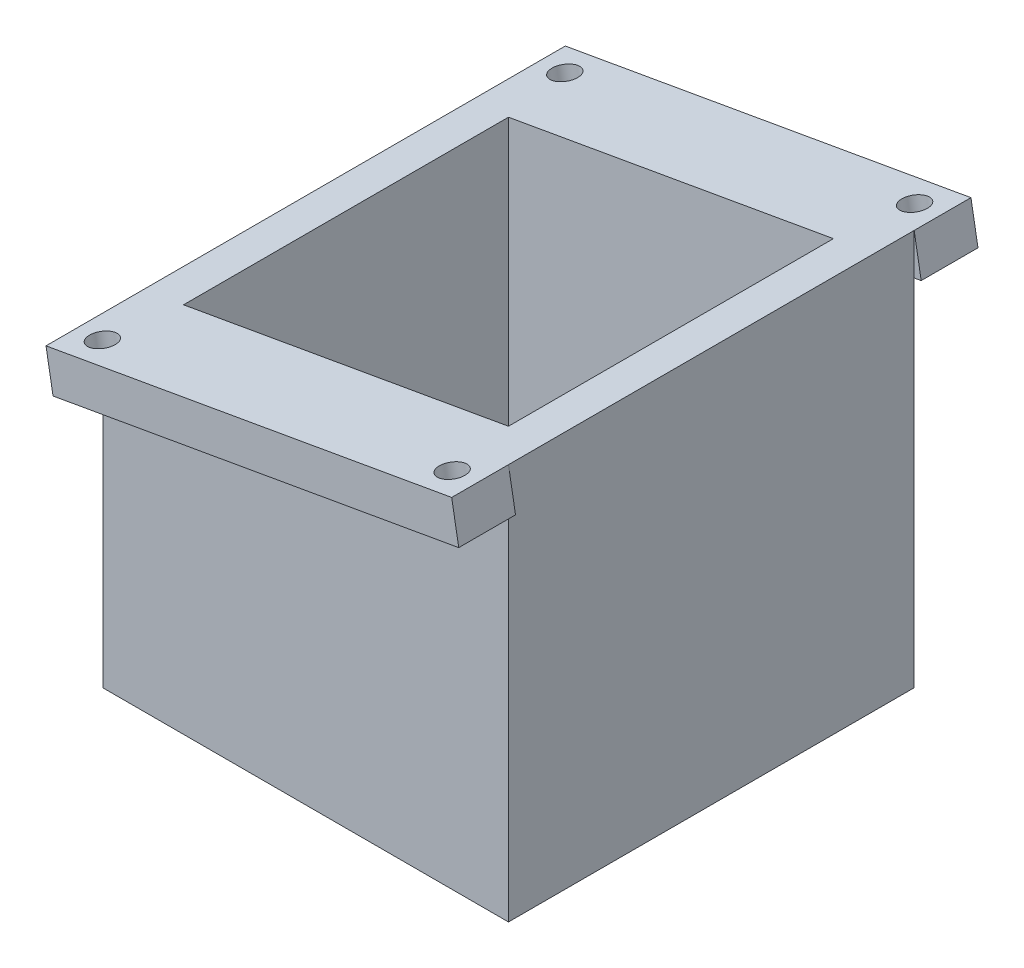
ISO-10303-21;
HEADER;
FILE_DESCRIPTION(('STEP AP214'),'2;1');
FILE_NAME('part.step','',(''),(''),'','','');
FILE_SCHEMA(('AUTOMOTIVE_DESIGN { 1 0 10303 214 1 1 1 1 }'));
ENDSEC;
DATA;
#1=APPLICATION_CONTEXT('core data for automotive mechanical design processes');
#2=APPLICATION_PROTOCOL_DEFINITION('international standard','automotive_design',2000,#1);
#3=PRODUCT_CONTEXT('',#1,'mechanical');
#4=PRODUCT('Part','Part','',(#3));
#5=PRODUCT_RELATED_PRODUCT_CATEGORY('part','',(#4));
#6=PRODUCT_DEFINITION_FORMATION('','',#4);
#7=PRODUCT_DEFINITION_CONTEXT('part definition',#1,'design');
#8=PRODUCT_DEFINITION('design','',#6,#7);
#9=PRODUCT_DEFINITION_SHAPE('','',#8);
#10=(LENGTH_UNIT() NAMED_UNIT(*) SI_UNIT(.MILLI.,.METRE.));
#11=(NAMED_UNIT(*) PLANE_ANGLE_UNIT() SI_UNIT($,.RADIAN.));
#12=(NAMED_UNIT(*) SI_UNIT($,.STERADIAN.) SOLID_ANGLE_UNIT());
#13=UNCERTAINTY_MEASURE_WITH_UNIT(LENGTH_MEASURE(1.E-05),#10,'distance_accuracy_value','');
#14=(GEOMETRIC_REPRESENTATION_CONTEXT(3) GLOBAL_UNCERTAINTY_ASSIGNED_CONTEXT((#13)) GLOBAL_UNIT_ASSIGNED_CONTEXT((#10,
#11,#12)) REPRESENTATION_CONTEXT('',''));
#15=CARTESIAN_POINT('',(0.,0.,0.));
#16=DIRECTION('',(0.,0.,1.));
#17=DIRECTION('',(1.,0.,0.));
#18=AXIS2_PLACEMENT_3D('',#15,#16,#17);
#19=CARTESIAN_POINT('',(25.,5.,-25.));
#20=DIRECTION('',(0.,0.,1.));
#21=DIRECTION('',(1.,0.,0.));
#22=AXIS2_PLACEMENT_3D('',#19,#20,#21);
#23=PLANE('',#22);
#24=DIRECTION('',(-0.17364819609251,0.984807749763281,0.));
#25=VECTOR('',#24,1.);
#26=CARTESIAN_POINT('',(-24.1317590195375,35.0759612511836,-25.));
#27=LINE('',#26,#25);
#28=CARTESIAN_POINT('',(-24.1317590195375,35.0759612511836,-25.));
#29=VERTEX_POINT('',#28);
#30=CARTESIAN_POINT('',(-25.,40.,-25.));
#31=VERTEX_POINT('',#30);
#32=EDGE_CURVE('E302',#29,#31,#27,.T.);
#33=ORIENTED_EDGE('',*,*,#32,.F.);
#34=DIRECTION('',(0.984807749763281,0.17364819609251,0.));
#35=VECTOR('',#34,1.);
#36=CARTESIAN_POINT('',(-24.1317590195375,35.0759612511836,-25.));
#37=LINE('',#36,#35);
#38=CARTESIAN_POINT('',(25.,43.7392169238216,-25.));
#39=VERTEX_POINT('',#38);
#40=EDGE_CURVE('E293',#29,#39,#37,.T.);
#41=ORIENTED_EDGE('',*,*,#40,.T.);
#42=DIRECTION('',(0.,-1.,0.));
#43=VECTOR('',#42,1.);
#44=CARTESIAN_POINT('',(25.,5.,-25.));
#45=LINE('',#44,#43);
#46=CARTESIAN_POINT('',(25.,0.,-25.));
#47=VERTEX_POINT('',#46);
#48=EDGE_CURVE('E286',#39,#47,#45,.T.);
#49=ORIENTED_EDGE('',*,*,#48,.T.);
#50=DIRECTION('',(-1.,0.,0.));
#51=VECTOR('',#50,1.);
#52=CARTESIAN_POINT('',(25.,0.,-25.));
#53=LINE('',#52,#51);
#54=CARTESIAN_POINT('',(-25.,0.,-25.));
#55=VERTEX_POINT('',#54);
#56=EDGE_CURVE('E281',#47,#55,#53,.T.);
#57=ORIENTED_EDGE('',*,*,#56,.T.);
#58=DIRECTION('',(0.,-1.,0.));
#59=VECTOR('',#58,1.);
#60=CARTESIAN_POINT('',(-25.,5.,-25.));
#61=LINE('',#60,#59);
#62=EDGE_CURVE('E283',#31,#55,#61,.T.);
#63=ORIENTED_EDGE('',*,*,#62,.F.);
#64=EDGE_LOOP('',(#33,#41,#49,#57,#63));
#65=FACE_BOUND('',#64,.T.);
#66=ADVANCED_FACE('F40',(#65),#23,.F.);
#67=CARTESIAN_POINT('',(0.,5.,0.));
#68=DIRECTION('',(0.,-1.,0.));
#69=DIRECTION('',(0.,0.,-1.));
#70=AXIS2_PLACEMENT_3D('',#67,#68,#69);
#71=PLANE('',#70);
#72=DIRECTION('',(0.,0.,-1.));
#73=VECTOR('',#72,1.);
#74=CARTESIAN_POINT('',(20.025,5.,0.));
#75=LINE('',#74,#73);
#76=CARTESIAN_POINT('',(20.025,5.,20.025));
#77=VERTEX_POINT('',#76);
#78=CARTESIAN_POINT('',(20.025,5.,-20.025));
#79=VERTEX_POINT('',#78);
#80=EDGE_CURVE('E236',#77,#79,#75,.T.);
#81=ORIENTED_EDGE('',*,*,#80,.T.);
#82=DIRECTION('',(-1.,0.,0.));
#83=VECTOR('',#82,1.);
#84=CARTESIAN_POINT('',(0.,5.,-20.025));
#85=LINE('',#84,#83);
#86=CARTESIAN_POINT('',(-20.025,5.,-20.025));
#87=VERTEX_POINT('',#86);
#88=EDGE_CURVE('E239',#79,#87,#85,.T.);
#89=ORIENTED_EDGE('',*,*,#88,.T.);
#90=DIRECTION('',(0.,0.,1.));
#91=VECTOR('',#90,1.);
#92=CARTESIAN_POINT('',(-20.025,5.,0.));
#93=LINE('',#92,#91);
#94=CARTESIAN_POINT('',(-20.025,5.,20.025));
#95=VERTEX_POINT('',#94);
#96=EDGE_CURVE('E230',#87,#95,#93,.T.);
#97=ORIENTED_EDGE('',*,*,#96,.T.);
#98=DIRECTION('',(1.,0.,0.));
#99=VECTOR('',#98,1.);
#100=CARTESIAN_POINT('',(0.,5.,20.025));
#101=LINE('',#100,#99);
#102=EDGE_CURVE('E233',#95,#77,#101,.T.);
#103=ORIENTED_EDGE('',*,*,#102,.T.);
#104=EDGE_LOOP('',(#81,#89,#97,#103));
#105=FACE_BOUND('',#104,.T.);
#106=DIRECTION('',(0.,0.,1.));
#107=VECTOR('',#106,1.);
#108=CARTESIAN_POINT('',(-18.025,5.,-18.025));
#109=LINE('',#108,#107);
#110=CARTESIAN_POINT('',(-18.025,5.,-18.025));
#111=VERTEX_POINT('',#110);
#112=CARTESIAN_POINT('',(-18.025,5.,18.025));
#113=VERTEX_POINT('',#112);
#114=EDGE_CURVE('E243',#111,#113,#109,.T.);
#115=ORIENTED_EDGE('',*,*,#114,.F.);
#116=DIRECTION('',(-1.,0.,0.));
#117=VECTOR('',#116,1.);
#118=CARTESIAN_POINT('',(18.025,5.,-18.025));
#119=LINE('',#118,#117);
#120=CARTESIAN_POINT('',(18.025,5.,-18.025));
#121=VERTEX_POINT('',#120);
#122=EDGE_CURVE('E251',#121,#111,#119,.T.);
#123=ORIENTED_EDGE('',*,*,#122,.F.);
#124=DIRECTION('',(0.,0.,-1.));
#125=VECTOR('',#124,1.);
#126=CARTESIAN_POINT('',(18.025,5.,-18.025));
#127=LINE('',#126,#125);
#128=CARTESIAN_POINT('',(18.025,5.,18.025));
#129=VERTEX_POINT('',#128);
#130=EDGE_CURVE('E248',#129,#121,#127,.T.);
#131=ORIENTED_EDGE('',*,*,#130,.F.);
#132=DIRECTION('',(1.,0.,0.));
#133=VECTOR('',#132,1.);
#134=CARTESIAN_POINT('',(18.025,5.,18.025));
#135=LINE('',#134,#133);
#136=EDGE_CURVE('E245',#113,#129,#135,.T.);
#137=ORIENTED_EDGE('',*,*,#136,.F.);
#138=EDGE_LOOP('',(#115,#123,#131,#137));
#139=FACE_BOUND('',#138,.T.);
#140=ADVANCED_FACE('F333',(#105,#139),#71,.F.);
#141=CARTESIAN_POINT('',(0.,0.,0.));
#142=DIRECTION('',(0.,-1.,0.));
#143=DIRECTION('',(0.,0.,-1.));
#144=AXIS2_PLACEMENT_3D('',#141,#142,#143);
#145=PLANE('',#144);
#146=DIRECTION('',(-1.,0.,0.));
#147=VECTOR('',#146,1.);
#148=CARTESIAN_POINT('',(18.025,0.,-18.025));
#149=LINE('',#148,#147);
#150=CARTESIAN_POINT('',(18.025,0.,-18.025));
#151=VERTEX_POINT('',#150);
#152=CARTESIAN_POINT('',(-18.025,0.,-18.025));
#153=VERTEX_POINT('',#152);
#154=EDGE_CURVE('E246',#151,#153,#149,.T.);
#155=ORIENTED_EDGE('',*,*,#154,.T.);
#156=DIRECTION('',(0.,0.,1.));
#157=VECTOR('',#156,1.);
#158=CARTESIAN_POINT('',(-18.025,0.,-18.025));
#159=LINE('',#158,#157);
#160=CARTESIAN_POINT('',(-18.025,0.,18.025));
#161=VERTEX_POINT('',#160);
#162=EDGE_CURVE('E242',#153,#161,#159,.T.);
#163=ORIENTED_EDGE('',*,*,#162,.T.);
#164=DIRECTION('',(1.,0.,0.));
#165=VECTOR('',#164,1.);
#166=CARTESIAN_POINT('',(18.025,0.,18.025));
#167=LINE('',#166,#165);
#168=CARTESIAN_POINT('',(18.025,0.,18.025));
#169=VERTEX_POINT('',#168);
#170=EDGE_CURVE('E256',#161,#169,#167,.T.);
#171=ORIENTED_EDGE('',*,*,#170,.T.);
#172=DIRECTION('',(0.,0.,-1.));
#173=VECTOR('',#172,1.);
#174=CARTESIAN_POINT('',(18.025,0.,-18.025));
#175=LINE('',#174,#173);
#176=EDGE_CURVE('E259',#169,#151,#175,.T.);
#177=ORIENTED_EDGE('',*,*,#176,.T.);
#178=EDGE_LOOP('',(#155,#163,#171,#177));
#179=FACE_BOUND('',#178,.T.);
#180=DIRECTION('',(0.,0.,1.));
#181=VECTOR('',#180,1.);
#182=CARTESIAN_POINT('',(-25.,0.,-25.));
#183=LINE('',#182,#181);
#184=CARTESIAN_POINT('',(-25.,0.,25.));
#185=VERTEX_POINT('',#184);
#186=EDGE_CURVE('E273',#55,#185,#183,.T.);
#187=ORIENTED_EDGE('',*,*,#186,.F.);
#188=ORIENTED_EDGE('',*,*,#56,.F.);
#189=DIRECTION('',(0.,0.,-1.));
#190=VECTOR('',#189,1.);
#191=CARTESIAN_POINT('',(25.,0.,-25.));
#192=LINE('',#191,#190);
#193=CARTESIAN_POINT('',(25.,0.,25.));
#194=VERTEX_POINT('',#193);
#195=EDGE_CURVE('E279',#194,#47,#192,.T.);
#196=ORIENTED_EDGE('',*,*,#195,.F.);
#197=DIRECTION('',(1.,0.,0.));
#198=VECTOR('',#197,1.);
#199=CARTESIAN_POINT('',(25.,0.,25.));
#200=LINE('',#199,#198);
#201=EDGE_CURVE('E276',#185,#194,#200,.T.);
#202=ORIENTED_EDGE('',*,*,#201,.F.);
#203=EDGE_LOOP('',(#187,#188,#196,#202));
#204=FACE_BOUND('',#203,.T.);
#205=ADVANCED_FACE('F297',(#179,#204),#145,.T.);
#206=CARTESIAN_POINT('',(-25.,5.,-25.));
#207=DIRECTION('',(1.,0.,0.));
#208=DIRECTION('',(0.,0.,-1.));
#209=AXIS2_PLACEMENT_3D('',#206,#207,#208);
#210=PLANE('',#209);
#211=ORIENTED_EDGE('',*,*,#186,.T.);
#212=DIRECTION('',(0.,-1.,0.));
#213=VECTOR('',#212,1.);
#214=CARTESIAN_POINT('',(-25.,5.,25.));
#215=LINE('',#214,#213);
#216=CARTESIAN_POINT('',(-25.,40.,25.));
#217=VERTEX_POINT('',#216);
#218=EDGE_CURVE('E44',#217,#185,#215,.T.);
#219=ORIENTED_EDGE('',*,*,#218,.F.);
#220=DIRECTION('',(0.,0.,1.));
#221=VECTOR('',#220,1.);
#222=CARTESIAN_POINT('',(-25.,40.,25.));
#223=LINE('',#222,#221);
#224=EDGE_CURVE('E212',#31,#217,#223,.T.);
#225=ORIENTED_EDGE('',*,*,#224,.F.);
#226=ORIENTED_EDGE('',*,*,#62,.T.);
#227=EDGE_LOOP('',(#211,#219,#225,#226));
#228=FACE_BOUND('',#227,.T.);
#229=ADVANCED_FACE('F42',(#228),#210,.F.);
#230=CARTESIAN_POINT('',(25.,5.,25.));
#231=DIRECTION('',(0.,0.,-1.));
#232=DIRECTION('',(-1.,0.,0.));
#233=AXIS2_PLACEMENT_3D('',#230,#231,#232);
#234=PLANE('',#233);
#235=DIRECTION('',(0.,-1.,0.));
#236=VECTOR('',#235,1.);
#237=CARTESIAN_POINT('',(25.,5.,25.));
#238=LINE('',#237,#236);
#239=CARTESIAN_POINT('',(25.,43.7392169238216,25.));
#240=VERTEX_POINT('',#239);
#241=EDGE_CURVE('E181',#240,#194,#238,.T.);
#242=ORIENTED_EDGE('',*,*,#241,.F.);
#243=DIRECTION('',(-0.984807749763281,-0.17364819609251,0.));
#244=VECTOR('',#243,1.);
#245=CARTESIAN_POINT('',(-24.1317590195375,35.0759612511836,25.));
#246=LINE('',#245,#244);
#247=CARTESIAN_POINT('',(-24.1317590195375,35.0759612511836,25.));
#248=VERTEX_POINT('',#247);
#249=EDGE_CURVE('E11',#240,#248,#246,.T.);
#250=ORIENTED_EDGE('',*,*,#249,.T.);
#251=DIRECTION('',(-0.17364819609251,0.984807749763281,0.));
#252=VECTOR('',#251,1.);
#253=CARTESIAN_POINT('',(-24.1317590195375,35.0759612511836,25.));
#254=LINE('',#253,#252);
#255=EDGE_CURVE('E363',#248,#217,#254,.T.);
#256=ORIENTED_EDGE('',*,*,#255,.T.);
#257=ORIENTED_EDGE('',*,*,#218,.T.);
#258=ORIENTED_EDGE('',*,*,#201,.T.);
#259=EDGE_LOOP('',(#242,#250,#256,#257,#258));
#260=FACE_BOUND('',#259,.T.);
#261=ADVANCED_FACE('F356',(#260),#234,.F.);
#262=CARTESIAN_POINT('',(25.,5.,-25.));
#263=DIRECTION('',(-1.,0.,0.));
#264=DIRECTION('',(0.,0.,1.));
#265=AXIS2_PLACEMENT_3D('',#262,#263,#264);
#266=PLANE('',#265);
#267=ORIENTED_EDGE('',*,*,#195,.T.);
#268=ORIENTED_EDGE('',*,*,#48,.F.);
#269=CARTESIAN_POINT('',(25.,48.81635,-25.));
#270=VERTEX_POINT('',#269);
#271=EDGE_CURVE('E207',#270,#39,#45,.T.);
#272=ORIENTED_EDGE('',*,*,#271,.F.);
#273=DIRECTION('',(0.,0.,-1.));
#274=VECTOR('',#273,1.);
#275=CARTESIAN_POINT('',(25.,48.81635,25.));
#276=LINE('',#275,#274);
#277=CARTESIAN_POINT('',(25.,48.81635,25.));
#278=VERTEX_POINT('',#277);
#279=EDGE_CURVE('E198',#278,#270,#276,.T.);
#280=ORIENTED_EDGE('',*,*,#279,.F.);
#281=EDGE_CURVE('E173',#278,#240,#238,.T.);
#282=ORIENTED_EDGE('',*,*,#281,.T.);
#283=ORIENTED_EDGE('',*,*,#241,.T.);
#284=EDGE_LOOP('',(#267,#268,#272,#280,#282,#283));
#285=FACE_BOUND('',#284,.T.);
#286=ADVANCED_FACE('F205',(#285),#266,.F.);
#287=CARTESIAN_POINT('',(-18.025,5.,-18.025));
#288=DIRECTION('',(1.,0.,0.));
#289=DIRECTION('',(0.,0.,-1.));
#290=AXIS2_PLACEMENT_3D('',#287,#288,#289);
#291=PLANE('',#290);
#292=ORIENTED_EDGE('',*,*,#162,.F.);
#293=DIRECTION('',(0.,-1.,0.));
#294=VECTOR('',#293,1.);
#295=CARTESIAN_POINT('',(-18.025,5.,-18.025));
#296=LINE('',#295,#294);
#297=EDGE_CURVE('E253',#111,#153,#296,.T.);
#298=ORIENTED_EDGE('',*,*,#297,.F.);
#299=ORIENTED_EDGE('',*,*,#114,.T.);
#300=DIRECTION('',(0.,-1.,0.));
#301=VECTOR('',#300,1.);
#302=CARTESIAN_POINT('',(-18.025,5.,18.025));
#303=LINE('',#302,#301);
#304=EDGE_CURVE('E270',#113,#161,#303,.T.);
#305=ORIENTED_EDGE('',*,*,#304,.T.);
#306=EDGE_LOOP('',(#292,#298,#299,#305));
#307=FACE_BOUND('',#306,.T.);
#308=ADVANCED_FACE('F355',(#307),#291,.T.);
#309=CARTESIAN_POINT('',(18.025,5.,18.025));
#310=DIRECTION('',(0.,0.,-1.));
#311=DIRECTION('',(-1.,0.,0.));
#312=AXIS2_PLACEMENT_3D('',#309,#310,#311);
#313=PLANE('',#312);
#314=ORIENTED_EDGE('',*,*,#170,.F.);
#315=ORIENTED_EDGE('',*,*,#304,.F.);
#316=ORIENTED_EDGE('',*,*,#136,.T.);
#317=DIRECTION('',(0.,-1.,0.));
#318=VECTOR('',#317,1.);
#319=CARTESIAN_POINT('',(18.025,5.,18.025));
#320=LINE('',#319,#318);
#321=EDGE_CURVE('E268',#129,#169,#320,.T.);
#322=ORIENTED_EDGE('',*,*,#321,.T.);
#323=EDGE_LOOP('',(#314,#315,#316,#322));
#324=FACE_BOUND('',#323,.T.);
#325=ADVANCED_FACE('F645',(#324),#313,.T.);
#326=CARTESIAN_POINT('',(18.025,5.,-18.025));
#327=DIRECTION('',(-1.,0.,0.));
#328=DIRECTION('',(0.,0.,1.));
#329=AXIS2_PLACEMENT_3D('',#326,#327,#328);
#330=PLANE('',#329);
#331=ORIENTED_EDGE('',*,*,#176,.F.);
#332=ORIENTED_EDGE('',*,*,#321,.F.);
#333=ORIENTED_EDGE('',*,*,#130,.T.);
#334=DIRECTION('',(0.,-1.,0.));
#335=VECTOR('',#334,1.);
#336=CARTESIAN_POINT('',(18.025,5.,-18.025));
#337=LINE('',#336,#335);
#338=EDGE_CURVE('E266',#121,#151,#337,.T.);
#339=ORIENTED_EDGE('',*,*,#338,.T.);
#340=EDGE_LOOP('',(#331,#332,#333,#339));
#341=FACE_BOUND('',#340,.T.);
#342=ADVANCED_FACE('F634',(#341),#330,.T.);
#343=CARTESIAN_POINT('',(18.025,5.,-18.025));
#344=DIRECTION('',(0.,0.,1.));
#345=DIRECTION('',(1.,0.,0.));
#346=AXIS2_PLACEMENT_3D('',#343,#344,#345);
#347=PLANE('',#346);
#348=ORIENTED_EDGE('',*,*,#154,.F.);
#349=ORIENTED_EDGE('',*,*,#338,.F.);
#350=ORIENTED_EDGE('',*,*,#122,.T.);
#351=ORIENTED_EDGE('',*,*,#297,.T.);
#352=EDGE_LOOP('',(#348,#349,#350,#351));
#353=FACE_BOUND('',#352,.T.);
#354=ADVANCED_FACE('F344',(#353),#347,.T.);
#355=CARTESIAN_POINT('',(20.025,110.710678118655,-20.025));
#356=DIRECTION('',(0.,0.,1.));
#357=DIRECTION('',(1.,0.,0.));
#358=AXIS2_PLACEMENT_3D('',#355,#356,#357);
#359=PLANE('',#358);
#360=ORIENTED_EDGE('',*,*,#88,.F.);
#361=DIRECTION('',(0.,-1.,0.));
#362=VECTOR('',#361,1.);
#363=CARTESIAN_POINT('',(20.025,110.710678118655,-20.025));
#364=LINE('',#363,#362);
#365=CARTESIAN_POINT('',(20.025,47.939123175,-20.025));
#366=VERTEX_POINT('',#365);
#367=EDGE_CURVE('E223',#366,#79,#364,.T.);
#368=ORIENTED_EDGE('',*,*,#367,.F.);
#369=DIRECTION('',(-0.984807749763281,-0.17364819609251,0.));
#370=VECTOR('',#369,1.);
#371=CARTESIAN_POINT('',(31.6066827751661,49.9812865536967,-20.025));
#372=LINE('',#371,#370);
#373=CARTESIAN_POINT('',(-20.025,40.877226825,-20.025));
#374=VERTEX_POINT('',#373);
#375=EDGE_CURVE('E208',#366,#374,#372,.T.);
#376=ORIENTED_EDGE('',*,*,#375,.T.);
#377=DIRECTION('',(0.,-1.,0.));
#378=VECTOR('',#377,1.);
#379=CARTESIAN_POINT('',(-20.025,110.710678118655,-20.025));
#380=LINE('',#379,#378);
#381=EDGE_CURVE('E220',#374,#87,#380,.T.);
#382=ORIENTED_EDGE('',*,*,#381,.T.);
#383=EDGE_LOOP('',(#360,#368,#376,#382));
#384=FACE_BOUND('',#383,.T.);
#385=ADVANCED_FACE('F331',(#384),#359,.T.);
#386=CARTESIAN_POINT('',(20.025,110.710678118655,20.025));
#387=DIRECTION('',(-1.,0.,0.));
#388=DIRECTION('',(0.,0.,1.));
#389=AXIS2_PLACEMENT_3D('',#386,#387,#388);
#390=PLANE('',#389);
#391=ORIENTED_EDGE('',*,*,#80,.F.);
#392=DIRECTION('',(0.,-1.,0.));
#393=VECTOR('',#392,1.);
#394=CARTESIAN_POINT('',(20.025,110.710678118655,20.025));
#395=LINE('',#394,#393);
#396=CARTESIAN_POINT('',(20.025,47.939123175,20.025));
#397=VERTEX_POINT('',#396);
#398=EDGE_CURVE('E226',#397,#77,#395,.T.);
#399=ORIENTED_EDGE('',*,*,#398,.F.);
#400=DIRECTION('',(0.,0.,-1.));
#401=VECTOR('',#400,1.);
#402=CARTESIAN_POINT('',(20.025,47.939123175,20.025));
#403=LINE('',#402,#401);
#404=EDGE_CURVE('E307',#397,#366,#403,.T.);
#405=ORIENTED_EDGE('',*,*,#404,.T.);
#406=ORIENTED_EDGE('',*,*,#367,.T.);
#407=EDGE_LOOP('',(#391,#399,#405,#406));
#408=FACE_BOUND('',#407,.T.);
#409=ADVANCED_FACE('F336',(#408),#390,.T.);
#410=CARTESIAN_POINT('',(20.025,110.710678118655,20.025));
#411=DIRECTION('',(0.,0.,-1.));
#412=DIRECTION('',(-1.,0.,0.));
#413=AXIS2_PLACEMENT_3D('',#410,#411,#412);
#414=PLANE('',#413);
#415=ORIENTED_EDGE('',*,*,#102,.F.);
#416=DIRECTION('',(0.,-1.,0.));
#417=VECTOR('',#416,1.);
#418=CARTESIAN_POINT('',(-20.025,110.710678118655,20.025));
#419=LINE('',#418,#417);
#420=CARTESIAN_POINT('',(-20.025,40.877226825,20.025));
#421=VERTEX_POINT('',#420);
#422=EDGE_CURVE('E65',#421,#95,#419,.T.);
#423=ORIENTED_EDGE('',*,*,#422,.F.);
#424=DIRECTION('',(0.984807749763281,0.17364819609251,0.));
#425=VECTOR('',#424,1.);
#426=CARTESIAN_POINT('',(31.6066827751661,49.9812865536967,20.025));
#427=LINE('',#426,#425);
#428=EDGE_CURVE('E214',#421,#397,#427,.T.);
#429=ORIENTED_EDGE('',*,*,#428,.T.);
#430=ORIENTED_EDGE('',*,*,#398,.T.);
#431=EDGE_LOOP('',(#415,#423,#429,#430));
#432=FACE_BOUND('',#431,.T.);
#433=ADVANCED_FACE('F324',(#432),#414,.T.);
#434=CARTESIAN_POINT('',(-20.025,110.710678118655,20.025));
#435=DIRECTION('',(1.,0.,0.));
#436=DIRECTION('',(0.,0.,-1.));
#437=AXIS2_PLACEMENT_3D('',#434,#435,#436);
#438=PLANE('',#437);
#439=ORIENTED_EDGE('',*,*,#96,.F.);
#440=ORIENTED_EDGE('',*,*,#381,.F.);
#441=DIRECTION('',(0.,0.,1.));
#442=VECTOR('',#441,1.);
#443=CARTESIAN_POINT('',(-20.025,40.877226825,20.025));
#444=LINE('',#443,#442);
#445=EDGE_CURVE('E209',#374,#421,#444,.T.);
#446=ORIENTED_EDGE('',*,*,#445,.T.);
#447=ORIENTED_EDGE('',*,*,#422,.T.);
#448=EDGE_LOOP('',(#439,#440,#446,#447));
#449=FACE_BOUND('',#448,.T.);
#450=ADVANCED_FACE('F329',(#449),#438,.T.);
#451=CARTESIAN_POINT('',(-7.59424596992729,43.0691043908606,0.));
#452=DIRECTION('',(-0.17364819609251,0.984807749763281,0.));
#453=DIRECTION('',(-0.984807749763281,-0.17364819609251,0.));
#454=AXIS2_PLACEMENT_3D('',#451,#452,#453);
#455=PLANE('',#454);
#456=CARTESIAN_POINT('',(-21.5531728758285,40.6077686863238,-28.5));
#457=DIRECTION('',(-0.17364819609251,0.984807749763281,0.));
#458=DIRECTION('',(0.984807749763281,0.17364819609251,0.));
#459=AXIS2_PLACEMENT_3D('',#456,#457,#458);
#460=CIRCLE('',#459,1.60000000000001);
#461=CARTESIAN_POINT('',(-19.9774804762073,40.8856058000718,-28.5));
#462=VERTEX_POINT('',#461);
#463=EDGE_CURVE('E429',#462,#462,#460,.T.);
#464=ORIENTED_EDGE('',*,*,#463,.F.);
#465=EDGE_LOOP('',(#464));
#466=FACE_BOUND('',#465,.T.);
#467=CARTESIAN_POINT('',(21.5531728758285,48.2085813136762,-28.5));
#468=DIRECTION('',(-0.17364819609251,0.984807749763281,0.));
#469=DIRECTION('',(-0.984807749763281,-0.17364819609251,0.));
#470=AXIS2_PLACEMENT_3D('',#467,#468,#469);
#471=CIRCLE('',#470,1.6);
#472=CARTESIAN_POINT('',(19.9774804762073,47.9307441999282,-28.5));
#473=VERTEX_POINT('',#472);
#474=EDGE_CURVE('E433',#473,#473,#471,.T.);
#475=ORIENTED_EDGE('',*,*,#474,.F.);
#476=EDGE_LOOP('',(#475));
#477=FACE_BOUND('',#476,.T.);
#478=CARTESIAN_POINT('',(21.5531728758285,48.2085813136762,28.5));
#479=DIRECTION('',(-0.17364819609251,0.984807749763281,0.));
#480=DIRECTION('',(0.984807749763281,0.17364819609251,0.));
#481=AXIS2_PLACEMENT_3D('',#478,#479,#480);
#482=CIRCLE('',#481,1.6);
#483=CARTESIAN_POINT('',(23.1288652754497,48.4864184274242,28.5));
#484=VERTEX_POINT('',#483);
#485=EDGE_CURVE('E437',#484,#484,#482,.T.);
#486=ORIENTED_EDGE('',*,*,#485,.F.);
#487=EDGE_LOOP('',(#486));
#488=FACE_BOUND('',#487,.T.);
#489=CARTESIAN_POINT('',(-21.5531728758285,40.6077686863238,28.5));
#490=DIRECTION('',(-0.17364819609251,0.984807749763281,0.));
#491=DIRECTION('',(-0.984807749763281,-0.17364819609251,0.));
#492=AXIS2_PLACEMENT_3D('',#489,#490,#491);
#493=CIRCLE('',#492,1.60000000000001);
#494=CARTESIAN_POINT('',(-23.1288652754498,40.3299315725758,28.5));
#495=VERTEX_POINT('',#494);
#496=EDGE_CURVE('E373',#495,#495,#493,.T.);
#497=ORIENTED_EDGE('',*,*,#496,.F.);
#498=EDGE_LOOP('',(#497));
#499=FACE_BOUND('',#498,.T.);
#500=ORIENTED_EDGE('',*,*,#445,.F.);
#501=ORIENTED_EDGE('',*,*,#375,.F.);
#502=ORIENTED_EDGE('',*,*,#404,.F.);
#503=ORIENTED_EDGE('',*,*,#428,.F.);
#504=EDGE_LOOP('',(#500,#501,#502,#503));
#505=FACE_BOUND('',#504,.T.);
#506=ORIENTED_EDGE('',*,*,#279,.T.);
#507=DIRECTION('',(0.,0.,-1.));
#508=VECTOR('',#507,1.);
#509=CARTESIAN_POINT('',(25.,48.81635,-25.));
#510=LINE('',#509,#508);
#511=CARTESIAN_POINT('',(25.,48.81635,-32.));
#512=VERTEX_POINT('',#511);
#513=EDGE_CURVE('E379',#270,#512,#510,.T.);
#514=ORIENTED_EDGE('',*,*,#513,.T.);
#515=DIRECTION('',(-0.984807749763281,-0.17364819609251,0.));
#516=VECTOR('',#515,1.);
#517=CARTESIAN_POINT('',(-25.,40.,-32.));
#518=LINE('',#517,#516);
#519=CARTESIAN_POINT('',(-25.,40.,-32.));
#520=VERTEX_POINT('',#519);
#521=EDGE_CURVE('E393',#512,#520,#518,.T.);
#522=ORIENTED_EDGE('',*,*,#521,.T.);
#523=DIRECTION('',(0.,0.,1.));
#524=VECTOR('',#523,1.);
#525=CARTESIAN_POINT('',(-25.,40.,-25.));
#526=LINE('',#525,#524);
#527=EDGE_CURVE('E315',#520,#31,#526,.T.);
#528=ORIENTED_EDGE('',*,*,#527,.T.);
#529=ORIENTED_EDGE('',*,*,#224,.T.);
#530=DIRECTION('',(0.,0.,1.));
#531=VECTOR('',#530,1.);
#532=CARTESIAN_POINT('',(-25.,40.,25.));
#533=LINE('',#532,#531);
#534=CARTESIAN_POINT('',(-25.,40.,32.));
#535=VERTEX_POINT('',#534);
#536=EDGE_CURVE('E378',#217,#535,#533,.T.);
#537=ORIENTED_EDGE('',*,*,#536,.T.);
#538=DIRECTION('',(0.984807749763281,0.17364819609251,0.));
#539=VECTOR('',#538,1.);
#540=CARTESIAN_POINT('',(-25.,40.,32.));
#541=LINE('',#540,#539);
#542=CARTESIAN_POINT('',(25.,48.81635,32.));
#543=VERTEX_POINT('',#542);
#544=EDGE_CURVE('E201',#535,#543,#541,.T.);
#545=ORIENTED_EDGE('',*,*,#544,.T.);
#546=DIRECTION('',(0.,0.,-1.));
#547=VECTOR('',#546,1.);
#548=CARTESIAN_POINT('',(25.,48.81635,25.));
#549=LINE('',#548,#547);
#550=EDGE_CURVE('E187',#543,#278,#549,.T.);
#551=ORIENTED_EDGE('',*,*,#550,.T.);
#552=EDGE_LOOP('',(#506,#514,#522,#528,#529,#537,#545,#551));
#553=FACE_BOUND('',#552,.T.);
#554=ADVANCED_FACE('F196',(#466,#477,#488,#499,#505,#553),#455,.T.);
#555=CARTESIAN_POINT('',(-24.1317590195375,35.0759612511836,-25.));
#556=DIRECTION('',(0.,0.,1.));
#557=DIRECTION('',(1.,0.,0.));
#558=AXIS2_PLACEMENT_3D('',#555,#556,#557);
#559=PLANE('',#558);
#560=DIRECTION('',(-0.17364819609251,0.984807749763281,0.));
#561=VECTOR('',#560,1.);
#562=CARTESIAN_POINT('',(25.8682409804625,43.8923112511836,-25.));
#563=LINE('',#562,#561);
#564=CARTESIAN_POINT('',(25.8682409804625,43.8923112511836,-25.));
#565=VERTEX_POINT('',#564);
#566=EDGE_CURVE('E319',#565,#270,#563,.T.);
#567=ORIENTED_EDGE('',*,*,#566,.T.);
#568=ORIENTED_EDGE('',*,*,#271,.T.);
#569=EDGE_CURVE('E57',#39,#565,#37,.T.);
#570=ORIENTED_EDGE('',*,*,#569,.T.);
#571=EDGE_LOOP('',(#567,#568,#570));
#572=FACE_BOUND('',#571,.T.);
#573=ADVANCED_FACE('F397',(#572),#559,.T.);
#574=CARTESIAN_POINT('',(-24.1317590195375,35.0759612511836,-25.));
#575=DIRECTION('',(-0.984807749763281,-0.17364819609251,0.));
#576=DIRECTION('',(0.17364819609251,-0.984807749763281,0.));
#577=AXIS2_PLACEMENT_3D('',#574,#575,#576);
#578=PLANE('',#577);
#579=ORIENTED_EDGE('',*,*,#527,.F.);
#580=DIRECTION('',(-0.17364819609251,0.984807749763281,0.));
#581=VECTOR('',#580,1.);
#582=CARTESIAN_POINT('',(-24.1317590195375,35.0759612511836,-32.));
#583=LINE('',#582,#581);
#584=CARTESIAN_POINT('',(-24.1317590195375,35.0759612511836,-32.));
#585=VERTEX_POINT('',#584);
#586=EDGE_CURVE('E308',#585,#520,#583,.T.);
#587=ORIENTED_EDGE('',*,*,#586,.F.);
#588=DIRECTION('',(0.,0.,1.));
#589=VECTOR('',#588,1.);
#590=CARTESIAN_POINT('',(-24.1317590195375,35.0759612511836,-25.));
#591=LINE('',#590,#589);
#592=EDGE_CURVE('E320',#585,#29,#591,.T.);
#593=ORIENTED_EDGE('',*,*,#592,.T.);
#594=ORIENTED_EDGE('',*,*,#32,.T.);
#595=EDGE_LOOP('',(#579,#587,#593,#594));
#596=FACE_BOUND('',#595,.T.);
#597=ADVANCED_FACE('F406',(#596),#578,.T.);
#598=CARTESIAN_POINT('',(-24.1317590195375,35.0759612511836,-32.));
#599=DIRECTION('',(0.,0.,-1.));
#600=DIRECTION('',(0.,1.,0.));
#601=AXIS2_PLACEMENT_3D('',#598,#599,#600);
#602=PLANE('',#601);
#603=ORIENTED_EDGE('',*,*,#521,.F.);
#604=DIRECTION('',(-0.17364819609251,0.984807749763281,0.));
#605=VECTOR('',#604,1.);
#606=CARTESIAN_POINT('',(25.8682409804625,43.8923112511836,-32.));
#607=LINE('',#606,#605);
#608=CARTESIAN_POINT('',(25.8682409804625,43.8923112511836,-32.));
#609=VERTEX_POINT('',#608);
#610=EDGE_CURVE('E312',#609,#512,#607,.T.);
#611=ORIENTED_EDGE('',*,*,#610,.F.);
#612=DIRECTION('',(-0.984807749763281,-0.17364819609251,0.));
#613=VECTOR('',#612,1.);
#614=CARTESIAN_POINT('',(-24.1317590195375,35.0759612511836,-32.));
#615=LINE('',#614,#613);
#616=EDGE_CURVE('E389',#609,#585,#615,.T.);
#617=ORIENTED_EDGE('',*,*,#616,.T.);
#618=ORIENTED_EDGE('',*,*,#586,.T.);
#619=EDGE_LOOP('',(#603,#611,#617,#618));
#620=FACE_BOUND('',#619,.T.);
#621=ADVANCED_FACE('F405',(#620),#602,.T.);
#622=CARTESIAN_POINT('',(25.8682409804625,43.8923112511836,-25.));
#623=DIRECTION('',(0.984807749763281,0.17364819609251,0.));
#624=DIRECTION('',(-0.17364819609251,0.984807749763281,0.));
#625=AXIS2_PLACEMENT_3D('',#622,#623,#624);
#626=PLANE('',#625);
#627=ORIENTED_EDGE('',*,*,#513,.F.);
#628=ORIENTED_EDGE('',*,*,#566,.F.);
#629=DIRECTION('',(0.,0.,-1.));
#630=VECTOR('',#629,1.);
#631=CARTESIAN_POINT('',(25.8682409804625,43.8923112511836,-25.));
#632=LINE('',#631,#630);
#633=EDGE_CURVE('E386',#565,#609,#632,.T.);
#634=ORIENTED_EDGE('',*,*,#633,.T.);
#635=ORIENTED_EDGE('',*,*,#610,.T.);
#636=EDGE_LOOP('',(#627,#628,#634,#635));
#637=FACE_BOUND('',#636,.T.);
#638=ADVANCED_FACE('F400',(#637),#626,.T.);
#639=CARTESIAN_POINT('',(-6.72600498946473,38.1450656420443,0.));
#640=DIRECTION('',(-0.17364819609251,0.984807749763281,0.));
#641=DIRECTION('',(-0.984807749763281,-0.17364819609251,0.));
#642=AXIS2_PLACEMENT_3D('',#639,#640,#641);
#643=PLANE('',#642);
#644=CARTESIAN_POINT('',(-20.684931895366,35.6837299375074,-28.5));
#645=DIRECTION('',(-0.17364819609251,0.984807749763281,0.));
#646=DIRECTION('',(0.984807749763281,0.17364819609251,0.));
#647=AXIS2_PLACEMENT_3D('',#644,#645,#646);
#648=CIRCLE('',#647,1.60000000000001);
#649=CARTESIAN_POINT('',(-19.1092394957447,35.9615670512554,-28.5));
#650=VERTEX_POINT('',#649);
#651=EDGE_CURVE('E453',#650,#650,#648,.T.);
#652=ORIENTED_EDGE('',*,*,#651,.T.);
#653=EDGE_LOOP('',(#652));
#654=FACE_BOUND('',#653,.T.);
#655=CARTESIAN_POINT('',(22.421413856291,43.2845425648598,-28.5));
#656=DIRECTION('',(-0.17364819609251,0.984807749763281,0.));
#657=DIRECTION('',(-0.984807749763281,-0.17364819609251,0.));
#658=AXIS2_PLACEMENT_3D('',#655,#656,#657);
#659=CIRCLE('',#658,1.6);
#660=CARTESIAN_POINT('',(20.8457214566698,43.0067054511118,-28.5));
#661=VERTEX_POINT('',#660);
#662=EDGE_CURVE('E449',#661,#661,#659,.T.);
#663=ORIENTED_EDGE('',*,*,#662,.T.);
#664=EDGE_LOOP('',(#663));
#665=FACE_BOUND('',#664,.T.);
#666=ORIENTED_EDGE('',*,*,#40,.F.);
#667=ORIENTED_EDGE('',*,*,#592,.F.);
#668=ORIENTED_EDGE('',*,*,#616,.F.);
#669=ORIENTED_EDGE('',*,*,#633,.F.);
#670=ORIENTED_EDGE('',*,*,#569,.F.);
#671=EDGE_LOOP('',(#666,#667,#668,#669,#670));
#672=FACE_BOUND('',#671,.T.);
#673=ADVANCED_FACE('F402',(#654,#665,#672),#643,.F.);
#674=CARTESIAN_POINT('',(-24.1317590195375,35.0759612511836,25.));
#675=DIRECTION('',(0.,0.,-1.));
#676=DIRECTION('',(0.,1.,0.));
#677=AXIS2_PLACEMENT_3D('',#674,#675,#676);
#678=PLANE('',#677);
#679=ORIENTED_EDGE('',*,*,#281,.F.);
#680=DIRECTION('',(-0.17364819609251,0.984807749763281,0.));
#681=VECTOR('',#680,1.);
#682=CARTESIAN_POINT('',(25.8682409804625,43.8923112511836,25.));
#683=LINE('',#682,#681);
#684=CARTESIAN_POINT('',(25.8682409804625,43.8923112511836,25.));
#685=VERTEX_POINT('',#684);
#686=EDGE_CURVE('E176',#685,#278,#683,.T.);
#687=ORIENTED_EDGE('',*,*,#686,.F.);
#688=EDGE_CURVE('E50',#685,#240,#246,.T.);
#689=ORIENTED_EDGE('',*,*,#688,.T.);
#690=EDGE_LOOP('',(#679,#687,#689));
#691=FACE_BOUND('',#690,.T.);
#692=ADVANCED_FACE('F175',(#691),#678,.T.);
#693=CARTESIAN_POINT('',(25.8682409804625,43.8923112511836,25.));
#694=DIRECTION('',(0.984807749763281,0.17364819609251,0.));
#695=DIRECTION('',(-0.17364819609251,0.984807749763281,0.));
#696=AXIS2_PLACEMENT_3D('',#693,#694,#695);
#697=PLANE('',#696);
#698=ORIENTED_EDGE('',*,*,#550,.F.);
#699=DIRECTION('',(-0.17364819609251,0.984807749763281,0.));
#700=VECTOR('',#699,1.);
#701=CARTESIAN_POINT('',(25.8682409804625,43.8923112511836,32.));
#702=LINE('',#701,#700);
#703=CARTESIAN_POINT('',(25.8682409804625,43.8923112511836,32.));
#704=VERTEX_POINT('',#703);
#705=EDGE_CURVE('E190',#704,#543,#702,.T.);
#706=ORIENTED_EDGE('',*,*,#705,.F.);
#707=DIRECTION('',(0.,0.,-1.));
#708=VECTOR('',#707,1.);
#709=CARTESIAN_POINT('',(25.8682409804625,43.8923112511836,25.));
#710=LINE('',#709,#708);
#711=EDGE_CURVE('E189',#704,#685,#710,.T.);
#712=ORIENTED_EDGE('',*,*,#711,.T.);
#713=ORIENTED_EDGE('',*,*,#686,.T.);
#714=EDGE_LOOP('',(#698,#706,#712,#713));
#715=FACE_BOUND('',#714,.T.);
#716=ADVANCED_FACE('F186',(#715),#697,.T.);
#717=CARTESIAN_POINT('',(-24.1317590195375,35.0759612511836,32.));
#718=DIRECTION('',(0.,0.,1.));
#719=DIRECTION('',(1.,0.,0.));
#720=AXIS2_PLACEMENT_3D('',#717,#718,#719);
#721=PLANE('',#720);
#722=ORIENTED_EDGE('',*,*,#544,.F.);
#723=DIRECTION('',(-0.17364819609251,0.984807749763281,0.));
#724=VECTOR('',#723,1.);
#725=CARTESIAN_POINT('',(-24.1317590195375,35.0759612511836,32.));
#726=LINE('',#725,#724);
#727=CARTESIAN_POINT('',(-24.1317590195375,35.0759612511836,32.));
#728=VERTEX_POINT('',#727);
#729=EDGE_CURVE('E367',#728,#535,#726,.T.);
#730=ORIENTED_EDGE('',*,*,#729,.F.);
#731=DIRECTION('',(0.984807749763281,0.17364819609251,0.));
#732=VECTOR('',#731,1.);
#733=CARTESIAN_POINT('',(-24.1317590195375,35.0759612511836,32.));
#734=LINE('',#733,#732);
#735=EDGE_CURVE('E369',#728,#704,#734,.T.);
#736=ORIENTED_EDGE('',*,*,#735,.T.);
#737=ORIENTED_EDGE('',*,*,#705,.T.);
#738=EDGE_LOOP('',(#722,#730,#736,#737));
#739=FACE_BOUND('',#738,.T.);
#740=ADVANCED_FACE('F482',(#739),#721,.T.);
#741=CARTESIAN_POINT('',(-24.1317590195375,35.0759612511836,25.));
#742=DIRECTION('',(-0.984807749763281,-0.17364819609251,0.));
#743=DIRECTION('',(0.17364819609251,-0.984807749763281,0.));
#744=AXIS2_PLACEMENT_3D('',#741,#742,#743);
#745=PLANE('',#744);
#746=ORIENTED_EDGE('',*,*,#536,.F.);
#747=ORIENTED_EDGE('',*,*,#255,.F.);
#748=DIRECTION('',(0.,0.,1.));
#749=VECTOR('',#748,1.);
#750=CARTESIAN_POINT('',(-24.1317590195375,35.0759612511836,25.));
#751=LINE('',#750,#749);
#752=EDGE_CURVE('E383',#248,#728,#751,.T.);
#753=ORIENTED_EDGE('',*,*,#752,.T.);
#754=ORIENTED_EDGE('',*,*,#729,.T.);
#755=EDGE_LOOP('',(#746,#747,#753,#754));
#756=FACE_BOUND('',#755,.T.);
#757=ADVANCED_FACE('F479',(#756),#745,.T.);
#758=CARTESIAN_POINT('',(-6.72600498946474,38.1450656420443,0.));
#759=DIRECTION('',(0.17364819609251,-0.984807749763281,0.));
#760=DIRECTION('',(0.984807749763281,0.17364819609251,0.));
#761=AXIS2_PLACEMENT_3D('',#758,#759,#760);
#762=PLANE('',#761);
#763=CARTESIAN_POINT('',(22.421413856291,43.2845425648598,28.5));
#764=DIRECTION('',(-0.17364819609251,0.984807749763281,0.));
#765=DIRECTION('',(0.984807749763281,0.17364819609251,0.));
#766=AXIS2_PLACEMENT_3D('',#763,#764,#765);
#767=CIRCLE('',#766,1.6);
#768=CARTESIAN_POINT('',(23.9971062559123,43.5623796786078,28.5));
#769=VERTEX_POINT('',#768);
#770=EDGE_CURVE('E442',#769,#769,#767,.T.);
#771=ORIENTED_EDGE('',*,*,#770,.T.);
#772=EDGE_LOOP('',(#771));
#773=FACE_BOUND('',#772,.T.);
#774=CARTESIAN_POINT('',(-20.684931895366,35.6837299375074,28.5));
#775=DIRECTION('',(-0.17364819609251,0.984807749763281,0.));
#776=DIRECTION('',(-0.984807749763281,-0.17364819609251,0.));
#777=AXIS2_PLACEMENT_3D('',#774,#775,#776);
#778=CIRCLE('',#777,1.60000000000001);
#779=CARTESIAN_POINT('',(-22.2606242949872,35.4058928237594,28.5));
#780=VERTEX_POINT('',#779);
#781=EDGE_CURVE('E191',#780,#780,#778,.T.);
#782=ORIENTED_EDGE('',*,*,#781,.T.);
#783=EDGE_LOOP('',(#782));
#784=FACE_BOUND('',#783,.T.);
#785=ORIENTED_EDGE('',*,*,#688,.F.);
#786=ORIENTED_EDGE('',*,*,#711,.F.);
#787=ORIENTED_EDGE('',*,*,#735,.F.);
#788=ORIENTED_EDGE('',*,*,#752,.F.);
#789=ORIENTED_EDGE('',*,*,#249,.F.);
#790=EDGE_LOOP('',(#785,#786,#787,#788,#789));
#791=FACE_BOUND('',#790,.T.);
#792=ADVANCED_FACE('F475',(#773,#784,#791),#762,.T.);
#793=CARTESIAN_POINT('',(-20.684931895366,35.6837299375074,28.5));
#794=DIRECTION('',(-0.17364819609251,0.984807749763281,0.));
#795=DIRECTION('',(-0.984807749763281,-0.17364819609251,0.));
#796=AXIS2_PLACEMENT_3D('',#793,#794,#795);
#797=CYLINDRICAL_SURFACE('',#796,1.60000000000001);
#798=ORIENTED_EDGE('',*,*,#781,.F.);
#799=EDGE_LOOP('',(#798));
#800=FACE_BOUND('',#799,.T.);
#801=ORIENTED_EDGE('',*,*,#496,.T.);
#802=EDGE_LOOP('',(#801));
#803=FACE_BOUND('',#802,.T.);
#804=ADVANCED_FACE('F472',(#800,#803),#797,.F.);
#805=CARTESIAN_POINT('',(22.421413856291,43.2845425648598,28.5));
#806=DIRECTION('',(-0.17364819609251,0.984807749763281,0.));
#807=DIRECTION('',(-0.984807749763281,-0.17364819609251,0.));
#808=AXIS2_PLACEMENT_3D('',#805,#806,#807);
#809=CYLINDRICAL_SURFACE('',#808,1.6);
#810=ORIENTED_EDGE('',*,*,#770,.F.);
#811=EDGE_LOOP('',(#810));
#812=FACE_BOUND('',#811,.T.);
#813=ORIENTED_EDGE('',*,*,#485,.T.);
#814=EDGE_LOOP('',(#813));
#815=FACE_BOUND('',#814,.T.);
#816=ADVANCED_FACE('F467',(#812,#815),#809,.F.);
#817=CARTESIAN_POINT('',(22.421413856291,43.2845425648598,-28.5));
#818=DIRECTION('',(-0.17364819609251,0.984807749763281,0.));
#819=DIRECTION('',(-0.984807749763281,-0.17364819609251,0.));
#820=AXIS2_PLACEMENT_3D('',#817,#818,#819);
#821=CYLINDRICAL_SURFACE('',#820,1.6);
#822=ORIENTED_EDGE('',*,*,#662,.F.);
#823=EDGE_LOOP('',(#822));
#824=FACE_BOUND('',#823,.T.);
#825=ORIENTED_EDGE('',*,*,#474,.T.);
#826=EDGE_LOOP('',(#825));
#827=FACE_BOUND('',#826,.T.);
#828=ADVANCED_FACE('F462',(#824,#827),#821,.F.);
#829=CARTESIAN_POINT('',(-20.684931895366,35.6837299375074,-28.5));
#830=DIRECTION('',(-0.17364819609251,0.984807749763281,0.));
#831=DIRECTION('',(-0.984807749763281,-0.17364819609251,0.));
#832=AXIS2_PLACEMENT_3D('',#829,#830,#831);
#833=CYLINDRICAL_SURFACE('',#832,1.60000000000001);
#834=ORIENTED_EDGE('',*,*,#651,.F.);
#835=EDGE_LOOP('',(#834));
#836=FACE_BOUND('',#835,.T.);
#837=ORIENTED_EDGE('',*,*,#463,.T.);
#838=EDGE_LOOP('',(#837));
#839=FACE_BOUND('',#838,.T.);
#840=ADVANCED_FACE('F459',(#836,#839),#833,.F.);
#841=CLOSED_SHELL('',(#66,#140,#205,#229,#261,#286,#308,#325,#342,#354,#385,#409,#433,#450,#554,
#573,#597,#621,#638,#673,#692,#716,#740,#757,#792,#804,#816,#828,#840));
#842=MANIFOLD_SOLID_BREP('B2',#841);
#843=ADVANCED_BREP_SHAPE_REPRESENTATION('',(#18,#842),#14);
#844=SHAPE_DEFINITION_REPRESENTATION(#9,#843);
ENDSEC;
END-ISO-10303-21;
